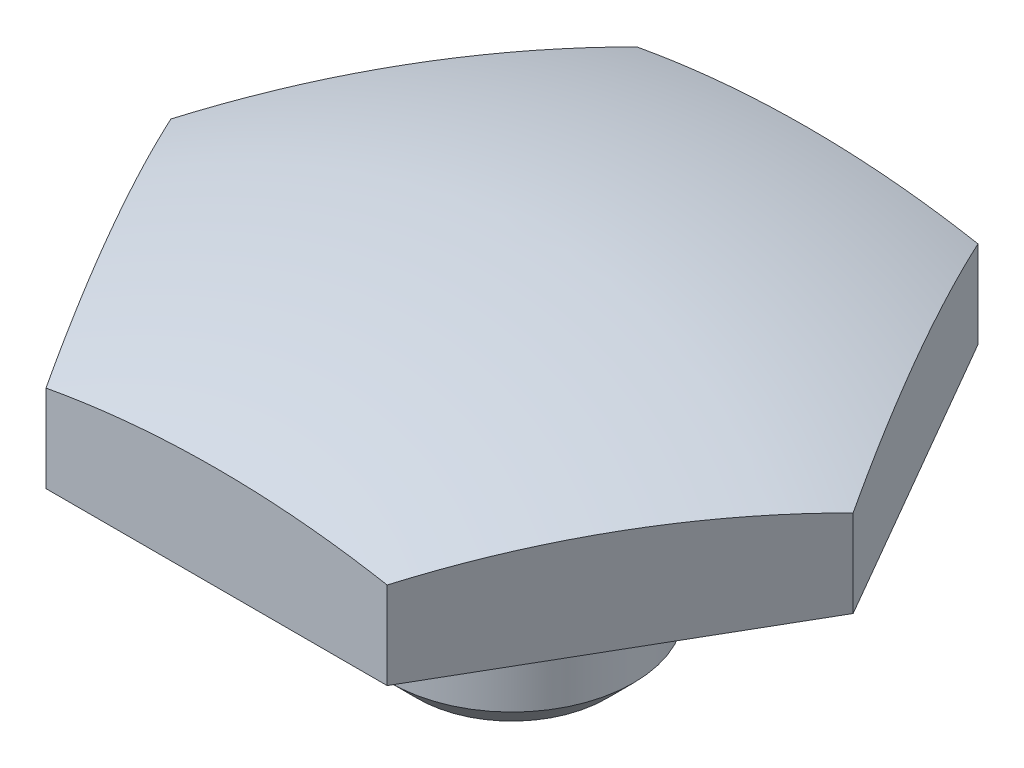
ISO-10303-21;
HEADER;
FILE_DESCRIPTION(('STEP AP214'),'2;1');
FILE_NAME('part.step','',(''),(''),'','','');
FILE_SCHEMA(('AUTOMOTIVE_DESIGN { 1 0 10303 214 1 1 1 1 }'));
ENDSEC;
DATA;
#1=APPLICATION_CONTEXT('core data for automotive mechanical design processes');
#2=APPLICATION_PROTOCOL_DEFINITION('international standard','automotive_design',2000,#1);
#3=PRODUCT_CONTEXT('',#1,'mechanical');
#4=PRODUCT('Part','Part','',(#3));
#5=PRODUCT_RELATED_PRODUCT_CATEGORY('part','',(#4));
#6=PRODUCT_DEFINITION_FORMATION('','',#4);
#7=PRODUCT_DEFINITION_CONTEXT('part definition',#1,'design');
#8=PRODUCT_DEFINITION('design','',#6,#7);
#9=PRODUCT_DEFINITION_SHAPE('','',#8);
#10=(LENGTH_UNIT() NAMED_UNIT(*) SI_UNIT(.MILLI.,.METRE.));
#11=(NAMED_UNIT(*) PLANE_ANGLE_UNIT() SI_UNIT($,.RADIAN.));
#12=(NAMED_UNIT(*) SI_UNIT($,.STERADIAN.) SOLID_ANGLE_UNIT());
#13=UNCERTAINTY_MEASURE_WITH_UNIT(LENGTH_MEASURE(1.E-05),#10,'distance_accuracy_value','');
#14=(GEOMETRIC_REPRESENTATION_CONTEXT(3) GLOBAL_UNCERTAINTY_ASSIGNED_CONTEXT((#13)) GLOBAL_UNIT_ASSIGNED_CONTEXT((#10,
#11,#12)) REPRESENTATION_CONTEXT('',''));
#15=CARTESIAN_POINT('',(0.,0.,0.));
#16=DIRECTION('',(0.,0.,1.));
#17=DIRECTION('',(1.,0.,0.));
#18=AXIS2_PLACEMENT_3D('',#15,#16,#17);
#19=CARTESIAN_POINT('',(0.,-20.6248,0.));
#20=DIRECTION('',(0.,-1.,0.));
#21=DIRECTION('',(1.,0.,0.));
#22=AXIS2_PLACEMENT_3D('',#19,#20,#21);
#23=SPHERICAL_SURFACE('',#22,31.75);
#24=CARTESIAN_POINT('',(-8.24889197104677,-20.6248,-4.7625));
#25=DIRECTION('',(0.866025403784438,0.,0.5));
#26=DIRECTION('',(0.5,0.,-0.866025403784439));
#27=AXIS2_PLACEMENT_3D('',#24,#25,#26);
#28=CIRCLE('',#27,30.287569644988);
#29=CARTESIAN_POINT('',(-10.9985226280624,9.15934102170976,0.));
#30=VERTEX_POINT('',#29);
#31=CARTESIAN_POINT('',(-5.49925618596527,9.15934102170976,-9.525));
#32=VERTEX_POINT('',#31);
#33=EDGE_CURVE('E106',#30,#32,#28,.F.);
#34=ORIENTED_EDGE('',*,*,#33,.F.);
#35=CARTESIAN_POINT('',(-8.24889197104677,-20.6248,4.7625));
#36=DIRECTION('',(0.866025403784438,0.,-0.5));
#37=DIRECTION('',(-0.5,0.,-0.866025403784439));
#38=AXIS2_PLACEMENT_3D('',#35,#36,#37);
#39=CIRCLE('',#38,30.287569644988);
#40=CARTESIAN_POINT('',(-5.49925618596527,9.15934196854072,9.525));
#41=VERTEX_POINT('',#40);
#42=EDGE_CURVE('E117',#41,#30,#39,.F.);
#43=ORIENTED_EDGE('',*,*,#42,.F.);
#44=CARTESIAN_POINT('',(0.,-20.6248,9.525));
#45=DIRECTION('',(0.,0.,-1.));
#46=DIRECTION('',(-1.,0.,0.));
#47=AXIS2_PLACEMENT_3D('',#44,#45,#46);
#48=CIRCLE('',#47,30.287569644988);
#49=CARTESIAN_POINT('',(5.49925618596531,9.15934102170977,9.525));
#50=VERTEX_POINT('',#49);
#51=EDGE_CURVE('E128',#50,#41,#48,.F.);
#52=ORIENTED_EDGE('',*,*,#51,.F.);
#53=CARTESIAN_POINT('',(8.24889197104678,-20.6248,4.7625));
#54=DIRECTION('',(-0.866025403784439,0.,-0.5));
#55=DIRECTION('',(-0.5,0.,0.866025403784439));
#56=AXIS2_PLACEMENT_3D('',#53,#54,#55);
#57=CIRCLE('',#56,30.287569644988);
#58=CARTESIAN_POINT('',(10.9985200640294,9.15934102170976,4.44103234742421E-06));
#59=VERTEX_POINT('',#58);
#60=EDGE_CURVE('E65',#59,#50,#57,.F.);
#61=ORIENTED_EDGE('',*,*,#60,.F.);
#62=CARTESIAN_POINT('',(8.24889197104678,-20.6248,-4.7625));
#63=DIRECTION('',(-0.866025403784438,0.,0.5));
#64=DIRECTION('',(0.5,0.,0.866025403784439));
#65=AXIS2_PLACEMENT_3D('',#62,#63,#64);
#66=CIRCLE('',#65,30.287569644988);
#67=CARTESIAN_POINT('',(5.49926387806152,9.15934102170976,-9.52499555896614));
#68=VERTEX_POINT('',#67);
#69=EDGE_CURVE('E222',#68,#59,#66,.F.);
#70=ORIENTED_EDGE('',*,*,#69,.F.);
#71=CARTESIAN_POINT('',(0.,-20.6248,-9.525));
#72=DIRECTION('',(0.,0.,1.));
#73=DIRECTION('',(1.,0.,0.));
#74=AXIS2_PLACEMENT_3D('',#71,#72,#73);
#75=CIRCLE('',#74,30.287569644988);
#76=EDGE_CURVE('E120',#32,#68,#75,.F.);
#77=ORIENTED_EDGE('',*,*,#76,.F.);
#78=EDGE_LOOP('',(#34,#43,#52,#61,#70,#77));
#79=FACE_BOUND('',#78,.T.);
#80=ADVANCED_FACE('F49',(#79),#23,.T.);
#81=CARTESIAN_POINT('',(0.,0.,0.));
#82=DIRECTION('',(0.,-1.,0.));
#83=DIRECTION('',(1.,0.,0.));
#84=AXIS2_PLACEMENT_3D('',#81,#82,#83);
#85=PLANE('',#84);
#86=CARTESIAN_POINT('',(0.,0.,0.));
#87=DIRECTION('',(0.,-1.,0.));
#88=DIRECTION('',(1.,0.,0.));
#89=AXIS2_PLACEMENT_3D('',#86,#87,#88);
#90=CIRCLE('',#89,3.04800000000001);
#91=CARTESIAN_POINT('',(3.04800000000001,0.,0.));
#92=VERTEX_POINT('',#91);
#93=EDGE_CURVE('E246',#92,#92,#90,.T.);
#94=ORIENTED_EDGE('',*,*,#93,.T.);
#95=EDGE_LOOP('',(#94));
#96=FACE_BOUND('',#95,.T.);
#97=ADVANCED_FACE('F300',(#96),#85,.T.);
#98=CARTESIAN_POINT('',(0.,0.,0.));
#99=DIRECTION('',(0.,1.,0.));
#100=DIRECTION('',(-1.,0.,0.));
#101=AXIS2_PLACEMENT_3D('',#98,#99,#100);
#102=CONICAL_SURFACE('',#101,3.04800000000001,0.785398163397594);
#103=CARTESIAN_POINT('',(0.,0.863599999999742,0.));
#104=DIRECTION('',(0.,-1.,0.));
#105=DIRECTION('',(1.,0.,0.));
#106=AXIS2_PLACEMENT_3D('',#103,#104,#105);
#107=CIRCLE('',#106,3.9116);
#108=CARTESIAN_POINT('',(3.9116,0.863599999999756,0.));
#109=VERTEX_POINT('',#108);
#110=EDGE_CURVE('E243',#109,#109,#107,.T.);
#111=ORIENTED_EDGE('',*,*,#110,.T.);
#112=EDGE_LOOP('',(#111));
#113=FACE_BOUND('',#112,.T.);
#114=ORIENTED_EDGE('',*,*,#93,.F.);
#115=EDGE_LOOP('',(#114));
#116=FACE_BOUND('',#115,.T.);
#117=ADVANCED_FACE('F304',(#113,#116),#102,.T.);
#118=CARTESIAN_POINT('',(3.49148133884313E-12,-1000.,0.));
#119=DIRECTION('',(0.,-1.,0.));
#120=DIRECTION('',(1.,0.,0.));
#121=AXIS2_PLACEMENT_3D('',#118,#119,#120);
#122=CYLINDRICAL_SURFACE('',#121,3.91160000000001);
#123=CARTESIAN_POINT('',(0.,3.50520000000021,0.));
#124=DIRECTION('',(0.,-1.,0.));
#125=DIRECTION('',(1.,0.,0.));
#126=AXIS2_PLACEMENT_3D('',#123,#124,#125);
#127=CIRCLE('',#126,3.91160000000001);
#128=CARTESIAN_POINT('',(3.9116,3.50520000000022,0.));
#129=VERTEX_POINT('',#128);
#130=EDGE_CURVE('E240',#129,#129,#127,.T.);
#131=ORIENTED_EDGE('',*,*,#130,.T.);
#132=EDGE_LOOP('',(#131));
#133=FACE_BOUND('',#132,.T.);
#134=ORIENTED_EDGE('',*,*,#110,.F.);
#135=EDGE_LOOP('',(#134));
#136=FACE_BOUND('',#135,.T.);
#137=ADVANCED_FACE('F308',(#133,#136),#122,.T.);
#138=CARTESIAN_POINT('',(0.,3.50520000000021,0.));
#139=DIRECTION('',(0.,-1.,0.));
#140=DIRECTION('',(1.,0.,0.));
#141=AXIS2_PLACEMENT_3D('',#138,#139,#140);
#142=CONICAL_SURFACE('',#141,3.91160000000001,0.785398163397595);
#143=CARTESIAN_POINT('',(0.,4.36879999999995,0.));
#144=DIRECTION('',(0.,-1.,0.));
#145=DIRECTION('',(1.,0.,0.));
#146=AXIS2_PLACEMENT_3D('',#143,#144,#145);
#147=CIRCLE('',#146,3.04800000000002);
#148=CARTESIAN_POINT('',(3.048,4.36879999999996,0.));
#149=VERTEX_POINT('',#148);
#150=EDGE_CURVE('E231',#149,#149,#147,.T.);
#151=ORIENTED_EDGE('',*,*,#150,.T.);
#152=EDGE_LOOP('',(#151));
#153=FACE_BOUND('',#152,.T.);
#154=ORIENTED_EDGE('',*,*,#130,.F.);
#155=EDGE_LOOP('',(#154));
#156=FACE_BOUND('',#155,.T.);
#157=ADVANCED_FACE('F314',(#153,#156),#142,.T.);
#158=CARTESIAN_POINT('',(3.49148133884313E-12,-1000.,0.));
#159=DIRECTION('',(0.,-1.,0.));
#160=DIRECTION('',(1.,0.,0.));
#161=AXIS2_PLACEMENT_3D('',#158,#159,#160);
#162=CYLINDRICAL_SURFACE('',#161,3.04800000000002);
#163=CARTESIAN_POINT('',(0.,5.96899999999989,0.));
#164=DIRECTION('',(0.,-1.,0.));
#165=DIRECTION('',(1.,0.,0.));
#166=AXIS2_PLACEMENT_3D('',#163,#164,#165);
#167=CIRCLE('',#166,3.04800000000002);
#168=CARTESIAN_POINT('',(3.048,5.9689999999999,0.));
#169=VERTEX_POINT('',#168);
#170=EDGE_CURVE('E226',#169,#169,#167,.T.);
#171=ORIENTED_EDGE('',*,*,#170,.T.);
#172=EDGE_LOOP('',(#171));
#173=FACE_BOUND('',#172,.T.);
#174=ORIENTED_EDGE('',*,*,#150,.F.);
#175=EDGE_LOOP('',(#174));
#176=FACE_BOUND('',#175,.T.);
#177=ADVANCED_FACE('F318',(#173,#176),#162,.T.);
#178=CARTESIAN_POINT('',(0.,5.969,0.));
#179=DIRECTION('',(0.,-1.,0.));
#180=DIRECTION('',(1.,0.,0.));
#181=AXIS2_PLACEMENT_3D('',#178,#179,#180);
#182=TOROIDAL_SURFACE('',#181,3.42900000000002,0.381);
#183=CARTESIAN_POINT('',(0.,6.35000000000008,0.));
#184=DIRECTION('',(0.,-1.,0.));
#185=DIRECTION('',(1.,0.,0.));
#186=AXIS2_PLACEMENT_3D('',#183,#184,#185);
#187=CIRCLE('',#186,3.42900000000003);
#188=CARTESIAN_POINT('',(3.429,6.35000000000009,0.));
#189=VERTEX_POINT('',#188);
#190=EDGE_CURVE('E224',#189,#189,#187,.T.);
#191=ORIENTED_EDGE('',*,*,#190,.T.);
#192=EDGE_LOOP('',(#191));
#193=FACE_BOUND('',#192,.T.);
#194=ORIENTED_EDGE('',*,*,#170,.F.);
#195=EDGE_LOOP('',(#194));
#196=FACE_BOUND('',#195,.T.);
#197=ADVANCED_FACE('F322',(#193,#196),#182,.F.);
#198=CARTESIAN_POINT('',(10.9985175,6.35000000000001,0.));
#199=DIRECTION('',(0.,-1.,0.));
#200=DIRECTION('',(1.,0.,0.));
#201=AXIS2_PLACEMENT_3D('',#198,#199,#200);
#202=PLANE('',#201);
#203=DIRECTION('',(-0.5,0.,0.866025403784439));
#204=VECTOR('',#203,1.);
#205=CARTESIAN_POINT('',(-5.49926259604677,6.34999999999996,-9.52499777948386));
#206=LINE('',#205,#204);
#207=CARTESIAN_POINT('',(-5.49926131403118,6.35,-9.525));
#208=VERTEX_POINT('',#207);
#209=CARTESIAN_POINT('',(-10.9985226280624,6.35000000000003,0.));
#210=VERTEX_POINT('',#209);
#211=EDGE_CURVE('E109',#208,#210,#206,.T.);
#212=ORIENTED_EDGE('',*,*,#211,.F.);
#213=DIRECTION('',(1.,0.,0.));
#214=VECTOR('',#213,1.);
#215=CARTESIAN_POINT('',(0.,6.35,-9.525));
#216=LINE('',#215,#214);
#217=CARTESIAN_POINT('',(5.49926131403119,6.35000000000002,-9.525));
#218=VERTEX_POINT('',#217);
#219=EDGE_CURVE('E259',#218,#208,#216,.F.);
#220=ORIENTED_EDGE('',*,*,#219,.F.);
#221=DIRECTION('',(0.5,0.,0.866025403784439));
#222=VECTOR('',#221,1.);
#223=CARTESIAN_POINT('',(8.24889197104678,6.35000000000001,-4.76250000000001));
#224=LINE('',#223,#222);
#225=CARTESIAN_POINT('',(10.9985226280624,6.35,0.));
#226=VERTEX_POINT('',#225);
#227=EDGE_CURVE('E194',#226,#218,#224,.F.);
#228=ORIENTED_EDGE('',*,*,#227,.F.);
#229=DIRECTION('',(-0.5,0.,0.866025403784439));
#230=VECTOR('',#229,1.);
#231=CARTESIAN_POINT('',(8.24889197104678,6.34999999999999,4.7625));
#232=LINE('',#231,#230);
#233=CARTESIAN_POINT('',(5.49926131403119,6.34999999999998,9.525));
#234=VERTEX_POINT('',#233);
#235=EDGE_CURVE('E177',#234,#226,#232,.F.);
#236=ORIENTED_EDGE('',*,*,#235,.F.);
#237=DIRECTION('',(-1.,0.,0.));
#238=VECTOR('',#237,1.);
#239=CARTESIAN_POINT('',(0.,6.34999999999996,9.525));
#240=LINE('',#239,#238);
#241=CARTESIAN_POINT('',(-5.49925618596527,6.34999999999996,9.52499999999999));
#242=VERTEX_POINT('',#241);
#243=EDGE_CURVE('E125',#242,#234,#240,.F.);
#244=ORIENTED_EDGE('',*,*,#243,.F.);
#245=DIRECTION('',(-0.5,0.,-0.866025403784439));
#246=VECTOR('',#245,1.);
#247=CARTESIAN_POINT('',(-8.24889197104677,6.34999999999994,4.7625));
#248=LINE('',#247,#246);
#249=EDGE_CURVE('E73',#210,#242,#248,.F.);
#250=ORIENTED_EDGE('',*,*,#249,.F.);
#251=EDGE_LOOP('',(#212,#220,#228,#236,#244,#250));
#252=FACE_BOUND('',#251,.T.);
#253=ORIENTED_EDGE('',*,*,#190,.F.);
#254=EDGE_LOOP('',(#253));
#255=FACE_BOUND('',#254,.T.);
#256=ADVANCED_FACE('F255',(#252,#255),#202,.T.);
#257=CARTESIAN_POINT('',(0.,11.1252,9.525));
#258=DIRECTION('',(0.,0.,-1.));
#259=DIRECTION('',(-1.,0.,0.));
#260=AXIS2_PLACEMENT_3D('',#257,#258,#259);
#261=PLANE('',#260);
#262=CARTESIAN_POINT('',(5.49926131403119,9.15934102170977,9.525));
#263=DIRECTION('',(0.,-1.,0.));
#264=VECTOR('',#263,1.);
#265=LINE('',#262,#264);
#266=EDGE_CURVE('E12',#50,#234,#265,.T.);
#267=ORIENTED_EDGE('',*,*,#266,.F.);
#268=ORIENTED_EDGE('',*,*,#51,.T.);
#269=CARTESIAN_POINT('',(-5.49925105789936,9.15934196854096,9.525));
#270=DIRECTION('',(0.,-1.,0.));
#271=VECTOR('',#270,1.);
#272=LINE('',#269,#271);
#273=EDGE_CURVE('E59',#41,#242,#272,.T.);
#274=ORIENTED_EDGE('',*,*,#273,.T.);
#275=ORIENTED_EDGE('',*,*,#243,.T.);
#276=EDGE_LOOP('',(#267,#268,#274,#275));
#277=FACE_BOUND('',#276,.T.);
#278=ADVANCED_FACE('F153',(#277),#261,.F.);
#279=CARTESIAN_POINT('',(-8.24889197104677,11.1252,4.7625));
#280=DIRECTION('',(0.866025403784438,0.,-0.5));
#281=DIRECTION('',(-0.5,0.,-0.866025403784439));
#282=AXIS2_PLACEMENT_3D('',#279,#280,#281);
#283=PLANE('',#282);
#284=ORIENTED_EDGE('',*,*,#42,.T.);
#285=CARTESIAN_POINT('',(-10.9985174999938,9.15934196854074,8.88207524630397E-06));
#286=DIRECTION('',(0.,-1.,0.));
#287=VECTOR('',#286,1.);
#288=LINE('',#285,#287);
#289=EDGE_CURVE('E103',#30,#210,#288,.T.);
#290=ORIENTED_EDGE('',*,*,#289,.T.);
#291=ORIENTED_EDGE('',*,*,#249,.T.);
#292=ORIENTED_EDGE('',*,*,#273,.F.);
#293=EDGE_LOOP('',(#284,#290,#291,#292));
#294=FACE_BOUND('',#293,.T.);
#295=ADVANCED_FACE('F123',(#294),#283,.F.);
#296=CARTESIAN_POINT('',(8.24889197104678,11.1252,4.7625));
#297=DIRECTION('',(-0.866025403784439,0.,-0.5));
#298=DIRECTION('',(-0.5,0.,0.866025403784439));
#299=AXIS2_PLACEMENT_3D('',#296,#297,#298);
#300=PLANE('',#299);
#301=ORIENTED_EDGE('',*,*,#60,.T.);
#302=ORIENTED_EDGE('',*,*,#266,.T.);
#303=ORIENTED_EDGE('',*,*,#235,.T.);
#304=CARTESIAN_POINT('',(10.9985226280624,9.15934102170976,0.));
#305=DIRECTION('',(0.,-1.,0.));
#306=VECTOR('',#305,1.);
#307=LINE('',#304,#306);
#308=EDGE_CURVE('E184',#59,#226,#307,.T.);
#309=ORIENTED_EDGE('',*,*,#308,.F.);
#310=EDGE_LOOP('',(#301,#302,#303,#309));
#311=FACE_BOUND('',#310,.T.);
#312=ADVANCED_FACE('F152',(#311),#300,.F.);
#313=CARTESIAN_POINT('',(8.24889197104678,11.1252,-4.76250000000001));
#314=DIRECTION('',(-0.866025403784438,0.,0.5));
#315=DIRECTION('',(0.5,0.,0.866025403784439));
#316=AXIS2_PLACEMENT_3D('',#313,#314,#315);
#317=PLANE('',#316);
#318=ORIENTED_EDGE('',*,*,#69,.T.);
#319=ORIENTED_EDGE('',*,*,#308,.T.);
#320=ORIENTED_EDGE('',*,*,#227,.T.);
#321=CARTESIAN_POINT('',(5.49926131403119,9.15934102170976,-9.525));
#322=DIRECTION('',(0.,-1.,0.));
#323=VECTOR('',#322,1.);
#324=LINE('',#321,#323);
#325=EDGE_CURVE('E260',#68,#218,#324,.T.);
#326=ORIENTED_EDGE('',*,*,#325,.F.);
#327=EDGE_LOOP('',(#318,#319,#320,#326));
#328=FACE_BOUND('',#327,.T.);
#329=ADVANCED_FACE('F196',(#328),#317,.F.);
#330=CARTESIAN_POINT('',(0.,11.1252,-9.525));
#331=DIRECTION('',(0.,0.,1.));
#332=DIRECTION('',(1.,0.,0.));
#333=AXIS2_PLACEMENT_3D('',#330,#331,#332);
#334=PLANE('',#333);
#335=ORIENTED_EDGE('',*,*,#76,.T.);
#336=ORIENTED_EDGE('',*,*,#325,.T.);
#337=ORIENTED_EDGE('',*,*,#219,.T.);
#338=CARTESIAN_POINT('',(-5.49926131403118,9.15934102170976,-9.525));
#339=DIRECTION('',(0.,-1.,0.));
#340=VECTOR('',#339,1.);
#341=LINE('',#338,#340);
#342=EDGE_CURVE('E121',#32,#208,#341,.T.);
#343=ORIENTED_EDGE('',*,*,#342,.F.);
#344=EDGE_LOOP('',(#335,#336,#337,#343));
#345=FACE_BOUND('',#344,.T.);
#346=ADVANCED_FACE('F205',(#345),#334,.F.);
#347=CARTESIAN_POINT('',(-8.24889197104677,11.1252,-4.7625));
#348=DIRECTION('',(0.866025403784438,0.,0.5));
#349=DIRECTION('',(0.5,0.,-0.866025403784439));
#350=AXIS2_PLACEMENT_3D('',#347,#348,#349);
#351=PLANE('',#350);
#352=ORIENTED_EDGE('',*,*,#33,.T.);
#353=ORIENTED_EDGE('',*,*,#342,.T.);
#354=ORIENTED_EDGE('',*,*,#211,.T.);
#355=ORIENTED_EDGE('',*,*,#289,.F.);
#356=EDGE_LOOP('',(#352,#353,#354,#355));
#357=FACE_BOUND('',#356,.T.);
#358=ADVANCED_FACE('F105',(#357),#351,.F.);
#359=CLOSED_SHELL('',(#80,#97,#117,#137,#157,#177,#197,#256,#278,#295,#312,#329,#346,#358));
#360=MANIFOLD_SOLID_BREP('B2',#359);
#361=ADVANCED_BREP_SHAPE_REPRESENTATION('',(#18,#360),#14);
#362=SHAPE_DEFINITION_REPRESENTATION(#9,#361);
ENDSEC;
END-ISO-10303-21;
